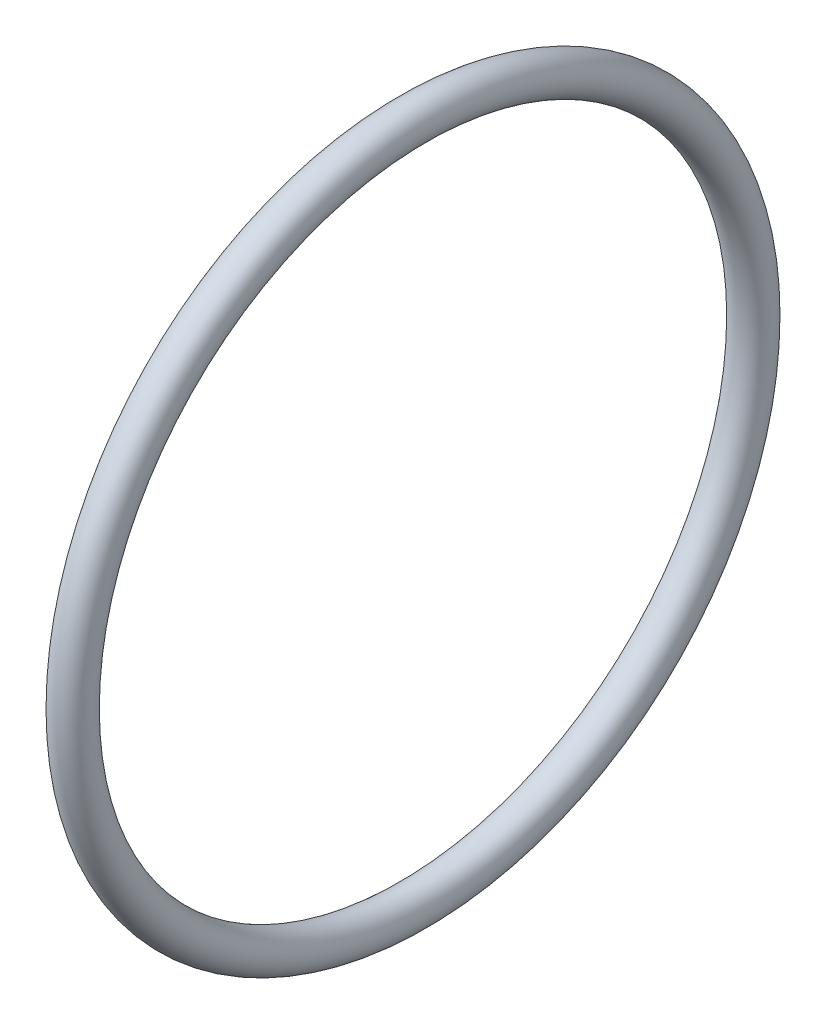
ISO-10303-21;
HEADER;
FILE_DESCRIPTION(('STEP AP214'),'2;1');
FILE_NAME('part.step','',(''),(''),'','','');
FILE_SCHEMA(('AUTOMOTIVE_DESIGN { 1 0 10303 214 1 1 1 1 }'));
ENDSEC;
DATA;
#1=APPLICATION_CONTEXT('core data for automotive mechanical design processes');
#2=APPLICATION_PROTOCOL_DEFINITION('international standard','automotive_design',2000,#1);
#3=PRODUCT_CONTEXT('',#1,'mechanical');
#4=PRODUCT('Part','Part','',(#3));
#5=PRODUCT_RELATED_PRODUCT_CATEGORY('part','',(#4));
#6=PRODUCT_DEFINITION_FORMATION('','',#4);
#7=PRODUCT_DEFINITION_CONTEXT('part definition',#1,'design');
#8=PRODUCT_DEFINITION('design','',#6,#7);
#9=PRODUCT_DEFINITION_SHAPE('','',#8);
#10=(LENGTH_UNIT() NAMED_UNIT(*) SI_UNIT(.MILLI.,.METRE.));
#11=(NAMED_UNIT(*) PLANE_ANGLE_UNIT() SI_UNIT($,.RADIAN.));
#12=(NAMED_UNIT(*) SI_UNIT($,.STERADIAN.) SOLID_ANGLE_UNIT());
#13=UNCERTAINTY_MEASURE_WITH_UNIT(LENGTH_MEASURE(1.E-05),#10,'distance_accuracy_value','');
#14=(GEOMETRIC_REPRESENTATION_CONTEXT(3) GLOBAL_UNCERTAINTY_ASSIGNED_CONTEXT((#13)) GLOBAL_UNIT_ASSIGNED_CONTEXT((#10,
#11,#12)) REPRESENTATION_CONTEXT('',''));
#15=CARTESIAN_POINT('',(0.,0.,0.));
#16=DIRECTION('',(0.,0.,1.));
#17=DIRECTION('',(1.,0.,0.));
#18=AXIS2_PLACEMENT_3D('',#15,#16,#17);
#19=CARTESIAN_POINT('',(0.,0.,0.));
#20=DIRECTION('',(1.,0.,0.));
#21=DIRECTION('',(0.,0.,-1.));
#22=AXIS2_PLACEMENT_3D('',#19,#20,#21);
#23=TOROIDAL_SURFACE('',#22,27.075,1.5);
#24=CARTESIAN_POINT('',(0.,0.,-28.575));
#25=VERTEX_POINT('',#24);
#26=VERTEX_LOOP('',#25);
#27=FACE_BOUND('',#26,.T.);
#28=ADVANCED_FACE('F36',(#27),#23,.T.);
#29=CLOSED_SHELL('',(#28));
#30=MANIFOLD_SOLID_BREP('B2',#29);
#31=ADVANCED_BREP_SHAPE_REPRESENTATION('',(#18,#30),#14);
#32=SHAPE_DEFINITION_REPRESENTATION(#9,#31);
ENDSEC;
END-ISO-10303-21;
